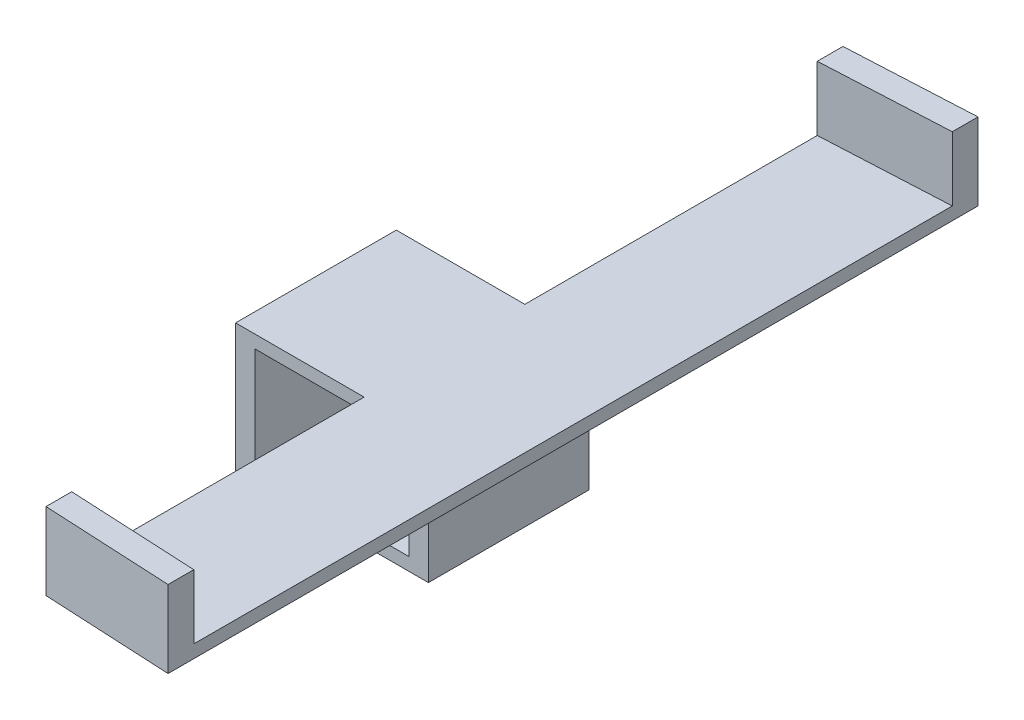
ISO-10303-21;
HEADER;
FILE_DESCRIPTION(('STEP AP214'),'2;1');
FILE_NAME('part.step','',(''),(''),'','','');
FILE_SCHEMA(('AUTOMOTIVE_DESIGN { 1 0 10303 214 1 1 1 1 }'));
ENDSEC;
DATA;
#1=APPLICATION_CONTEXT('core data for automotive mechanical design processes');
#2=APPLICATION_PROTOCOL_DEFINITION('international standard','automotive_design',2000,#1);
#3=PRODUCT_CONTEXT('',#1,'mechanical');
#4=PRODUCT('Part','Part','',(#3));
#5=PRODUCT_RELATED_PRODUCT_CATEGORY('part','',(#4));
#6=PRODUCT_DEFINITION_FORMATION('','',#4);
#7=PRODUCT_DEFINITION_CONTEXT('part definition',#1,'design');
#8=PRODUCT_DEFINITION('design','',#6,#7);
#9=PRODUCT_DEFINITION_SHAPE('','',#8);
#10=(LENGTH_UNIT() NAMED_UNIT(*) SI_UNIT(.MILLI.,.METRE.));
#11=(NAMED_UNIT(*) PLANE_ANGLE_UNIT() SI_UNIT($,.RADIAN.));
#12=(NAMED_UNIT(*) SI_UNIT($,.STERADIAN.) SOLID_ANGLE_UNIT());
#13=UNCERTAINTY_MEASURE_WITH_UNIT(LENGTH_MEASURE(1.E-05),#10,'distance_accuracy_value','');
#14=(GEOMETRIC_REPRESENTATION_CONTEXT(3) GLOBAL_UNCERTAINTY_ASSIGNED_CONTEXT((#13)) GLOBAL_UNIT_ASSIGNED_CONTEXT((#10,
#11,#12)) REPRESENTATION_CONTEXT('',''));
#15=CARTESIAN_POINT('',(0.,0.,0.));
#16=DIRECTION('',(0.,0.,1.));
#17=DIRECTION('',(1.,0.,0.));
#18=AXIS2_PLACEMENT_3D('',#15,#16,#17);
#19=CARTESIAN_POINT('',(0.,20.,0.));
#20=DIRECTION('',(0.,1.,0.));
#21=DIRECTION('',(0.,0.,1.));
#22=AXIS2_PLACEMENT_3D('',#19,#20,#21);
#23=PLANE('',#22);
#24=DIRECTION('',(0.998728172106602,0.,0.0504186298961642));
#25=VECTOR('',#24,1.);
#26=CARTESIAN_POINT('',(9.6788990825688,20.,58.9355386187338));
#27=LINE('',#26,#25);
#28=CARTESIAN_POINT('',(9.6788990825688,20.,58.9355386187338));
#29=VERTEX_POINT('',#28);
#30=CARTESIAN_POINT('',(29.6788990825688,20.,59.9451953262204));
#31=VERTEX_POINT('',#30);
#32=EDGE_CURVE('E59',#29,#31,#27,.T.);
#33=ORIENTED_EDGE('',*,*,#32,.T.);
#34=DIRECTION('',(0.,0.,1.));
#35=VECTOR('',#34,1.);
#36=CARTESIAN_POINT('',(29.6788990825688,20.,13.4403669724771));
#37=LINE('',#36,#35);
#38=CARTESIAN_POINT('',(29.6788990825688,20.,-58.0644613812662));
#39=VERTEX_POINT('',#38);
#40=EDGE_CURVE('E271',#39,#31,#37,.T.);
#41=ORIENTED_EDGE('',*,*,#40,.F.);
#42=DIRECTION('',(-0.998728172106602,0.,0.050418629896159));
#43=VECTOR('',#42,1.);
#44=CARTESIAN_POINT('',(29.6788990825688,20.,-58.0644613812662));
#45=LINE('',#44,#43);
#46=CARTESIAN_POINT('',(9.67889908256879,20.,-57.0548046737797));
#47=VERTEX_POINT('',#46);
#48=EDGE_CURVE('E201',#39,#47,#45,.T.);
#49=ORIENTED_EDGE('',*,*,#48,.T.);
#50=DIRECTION('',(0.,0.,1.));
#51=VECTOR('',#50,1.);
#52=CARTESIAN_POINT('',(9.6788990825688,20.,0.));
#53=LINE('',#52,#51);
#54=CARTESIAN_POINT('',(9.6788990825688,20.,-11.5596330275229));
#55=VERTEX_POINT('',#54);
#56=EDGE_CURVE('E180',#47,#55,#53,.T.);
#57=ORIENTED_EDGE('',*,*,#56,.T.);
#58=DIRECTION('',(-1.,0.,0.));
#59=VECTOR('',#58,1.);
#60=CARTESIAN_POINT('',(19.6788990825688,20.,-11.5596330275229));
#61=LINE('',#60,#59);
#62=CARTESIAN_POINT('',(-10.3211009174312,20.,-11.5596330275229));
#63=VERTEX_POINT('',#62);
#64=EDGE_CURVE('E333',#55,#63,#61,.T.);
#65=ORIENTED_EDGE('',*,*,#64,.T.);
#66=DIRECTION('',(0.,0.,1.));
#67=VECTOR('',#66,1.);
#68=CARTESIAN_POINT('',(-10.3211009174312,20.,-11.5596330275229));
#69=LINE('',#68,#67);
#70=CARTESIAN_POINT('',(-10.3211009174312,20.,13.4403669724771));
#71=VERTEX_POINT('',#70);
#72=EDGE_CURVE('E336',#63,#71,#69,.T.);
#73=ORIENTED_EDGE('',*,*,#72,.T.);
#74=DIRECTION('',(1.,0.,0.));
#75=VECTOR('',#74,1.);
#76=CARTESIAN_POINT('',(-10.3211009174312,20.,13.4403669724771));
#77=LINE('',#76,#75);
#78=CARTESIAN_POINT('',(9.6788990825688,20.,13.4403669724771));
#79=VERTEX_POINT('',#78);
#80=EDGE_CURVE('E340',#71,#79,#77,.T.);
#81=ORIENTED_EDGE('',*,*,#80,.T.);
#82=DIRECTION('',(0.,0.,1.));
#83=VECTOR('',#82,1.);
#84=CARTESIAN_POINT('',(9.6788990825688,20.,0.));
#85=LINE('',#84,#83);
#86=EDGE_CURVE('E64',#79,#29,#85,.T.);
#87=ORIENTED_EDGE('',*,*,#86,.T.);
#88=EDGE_LOOP('',(#33,#41,#49,#57,#65,#73,#81,#87));
#89=FACE_BOUND('',#88,.T.);
#90=ADVANCED_FACE('F41',(#89),#23,.T.);
#91=CARTESIAN_POINT('',(0.,18.,13.4403669724771));
#92=DIRECTION('',(0.,0.,-1.));
#93=DIRECTION('',(-1.,0.,0.));
#94=AXIS2_PLACEMENT_3D('',#91,#92,#93);
#95=PLANE('',#94);
#96=DIRECTION('',(1.,0.,0.));
#97=VECTOR('',#96,1.);
#98=CARTESIAN_POINT('',(0.,18.,13.4403669724771));
#99=LINE('',#98,#97);
#100=CARTESIAN_POINT('',(16.6788990825688,18.,13.4403669724771));
#101=VERTEX_POINT('',#100);
#102=CARTESIAN_POINT('',(19.6788990825688,18.,13.4403669724771));
#103=VERTEX_POINT('',#102);
#104=EDGE_CURVE('E11',#101,#103,#99,.T.);
#105=ORIENTED_EDGE('',*,*,#104,.F.);
#106=DIRECTION('',(0.,1.,0.));
#107=VECTOR('',#106,1.);
#108=CARTESIAN_POINT('',(16.6788990825688,2.,13.4403669724771));
#109=LINE('',#108,#107);
#110=CARTESIAN_POINT('',(16.6788990825688,2.,13.4403669724771));
#111=VERTEX_POINT('',#110);
#112=EDGE_CURVE('E297',#111,#101,#109,.T.);
#113=ORIENTED_EDGE('',*,*,#112,.F.);
#114=DIRECTION('',(1.,0.,0.));
#115=VECTOR('',#114,1.);
#116=CARTESIAN_POINT('',(-7.32110091743119,2.,13.4403669724771));
#117=LINE('',#116,#115);
#118=CARTESIAN_POINT('',(-7.32110091743119,2.,13.4403669724771));
#119=VERTEX_POINT('',#118);
#120=EDGE_CURVE('E274',#119,#111,#117,.T.);
#121=ORIENTED_EDGE('',*,*,#120,.F.);
#122=DIRECTION('',(0.,1.,0.));
#123=VECTOR('',#122,1.);
#124=CARTESIAN_POINT('',(-7.32110091743119,2.,13.4403669724771));
#125=LINE('',#124,#123);
#126=CARTESIAN_POINT('',(-7.32110091743119,18.,13.4403669724771));
#127=VERTEX_POINT('',#126);
#128=EDGE_CURVE('E283',#119,#127,#125,.T.);
#129=ORIENTED_EDGE('',*,*,#128,.T.);
#130=DIRECTION('',(-1.,0.,0.));
#131=VECTOR('',#130,1.);
#132=CARTESIAN_POINT('',(16.6788990825688,18.,13.4403669724771));
#133=LINE('',#132,#131);
#134=CARTESIAN_POINT('',(9.6788990825688,18.,13.4403669724771));
#135=VERTEX_POINT('',#134);
#136=EDGE_CURVE('E301',#135,#127,#133,.T.);
#137=ORIENTED_EDGE('',*,*,#136,.F.);
#138=DIRECTION('',(0.,1.,0.));
#139=VECTOR('',#138,1.);
#140=CARTESIAN_POINT('',(9.6788990825688,18.,13.4403669724771));
#141=LINE('',#140,#139);
#142=EDGE_CURVE('E181',#135,#79,#141,.T.);
#143=ORIENTED_EDGE('',*,*,#142,.T.);
#144=ORIENTED_EDGE('',*,*,#80,.F.);
#145=DIRECTION('',(0.,-1.,0.));
#146=VECTOR('',#145,1.);
#147=CARTESIAN_POINT('',(-10.3211009174312,18.,13.4403669724771));
#148=LINE('',#147,#146);
#149=CARTESIAN_POINT('',(-10.3211009174312,0.,13.4403669724771));
#150=VERTEX_POINT('',#149);
#151=EDGE_CURVE('E377',#71,#150,#148,.T.);
#152=ORIENTED_EDGE('',*,*,#151,.T.);
#153=DIRECTION('',(1.,0.,0.));
#154=VECTOR('',#153,1.);
#155=CARTESIAN_POINT('',(0.,0.,13.4403669724771));
#156=LINE('',#155,#154);
#157=CARTESIAN_POINT('',(19.6788990825688,0.,13.4403669724771));
#158=VERTEX_POINT('',#157);
#159=EDGE_CURVE('E354',#150,#158,#156,.T.);
#160=ORIENTED_EDGE('',*,*,#159,.T.);
#161=DIRECTION('',(0.,-1.,0.));
#162=VECTOR('',#161,1.);
#163=CARTESIAN_POINT('',(19.6788990825688,18.,13.4403669724771));
#164=LINE('',#163,#162);
#165=EDGE_CURVE('E374',#103,#158,#164,.T.);
#166=ORIENTED_EDGE('',*,*,#165,.F.);
#167=EDGE_LOOP('',(#105,#113,#121,#129,#137,#143,#144,#152,#160,#166));
#168=FACE_BOUND('',#167,.T.);
#169=ADVANCED_FACE('F404',(#168),#95,.F.);
#170=CARTESIAN_POINT('',(19.6788990825688,18.,0.));
#171=DIRECTION('',(1.,0.,0.));
#172=DIRECTION('',(0.,0.,-1.));
#173=AXIS2_PLACEMENT_3D('',#170,#171,#172);
#174=PLANE('',#173);
#175=DIRECTION('',(0.,0.,-1.));
#176=VECTOR('',#175,1.);
#177=CARTESIAN_POINT('',(19.6788990825688,18.,13.4403669724771));
#178=LINE('',#177,#176);
#179=CARTESIAN_POINT('',(19.6788990825688,18.,-11.5596330275229));
#180=VERTEX_POINT('',#179);
#181=EDGE_CURVE('E261',#103,#180,#178,.T.);
#182=ORIENTED_EDGE('',*,*,#181,.F.);
#183=ORIENTED_EDGE('',*,*,#165,.T.);
#184=DIRECTION('',(0.,0.,1.));
#185=VECTOR('',#184,1.);
#186=CARTESIAN_POINT('',(19.6788990825688,0.,0.));
#187=LINE('',#186,#185);
#188=CARTESIAN_POINT('',(19.6788990825688,0.,-11.5596330275229));
#189=VERTEX_POINT('',#188);
#190=EDGE_CURVE('E343',#189,#158,#187,.T.);
#191=ORIENTED_EDGE('',*,*,#190,.F.);
#192=DIRECTION('',(0.,-1.,0.));
#193=VECTOR('',#192,1.);
#194=CARTESIAN_POINT('',(19.6788990825688,18.,-11.5596330275229));
#195=LINE('',#194,#193);
#196=EDGE_CURVE('E255',#180,#189,#195,.T.);
#197=ORIENTED_EDGE('',*,*,#196,.F.);
#198=EDGE_LOOP('',(#182,#183,#191,#197));
#199=FACE_BOUND('',#198,.T.);
#200=ADVANCED_FACE('F43',(#199),#174,.T.);
#201=CARTESIAN_POINT('',(0.,18.,-11.5596330275229));
#202=DIRECTION('',(0.,0.,-1.));
#203=DIRECTION('',(-1.,0.,0.));
#204=AXIS2_PLACEMENT_3D('',#201,#202,#203);
#205=PLANE('',#204);
#206=DIRECTION('',(0.,1.,0.));
#207=VECTOR('',#206,1.);
#208=CARTESIAN_POINT('',(9.6788990825688,18.,-11.5596330275229));
#209=LINE('',#208,#207);
#210=CARTESIAN_POINT('',(9.6788990825688,18.,-11.5596330275229));
#211=VERTEX_POINT('',#210);
#212=EDGE_CURVE('E262',#211,#55,#209,.T.);
#213=ORIENTED_EDGE('',*,*,#212,.F.);
#214=DIRECTION('',(-1.,0.,0.));
#215=VECTOR('',#214,1.);
#216=CARTESIAN_POINT('',(16.6788990825688,18.,-11.5596330275229));
#217=LINE('',#216,#215);
#218=CARTESIAN_POINT('',(-7.32110091743119,18.,-11.5596330275229));
#219=VERTEX_POINT('',#218);
#220=EDGE_CURVE('E287',#211,#219,#217,.T.);
#221=ORIENTED_EDGE('',*,*,#220,.T.);
#222=DIRECTION('',(0.,1.,0.));
#223=VECTOR('',#222,1.);
#224=CARTESIAN_POINT('',(-7.32110091743119,2.,-11.5596330275229));
#225=LINE('',#224,#223);
#226=CARTESIAN_POINT('',(-7.32110091743119,2.,-11.5596330275229));
#227=VERTEX_POINT('',#226);
#228=EDGE_CURVE('E290',#227,#219,#225,.T.);
#229=ORIENTED_EDGE('',*,*,#228,.F.);
#230=DIRECTION('',(1.,0.,0.));
#231=VECTOR('',#230,1.);
#232=CARTESIAN_POINT('',(-7.32110091743119,2.,-11.5596330275229));
#233=LINE('',#232,#231);
#234=CARTESIAN_POINT('',(16.6788990825688,2.,-11.5596330275229));
#235=VERTEX_POINT('',#234);
#236=EDGE_CURVE('E278',#227,#235,#233,.T.);
#237=ORIENTED_EDGE('',*,*,#236,.T.);
#238=DIRECTION('',(0.,1.,0.));
#239=VECTOR('',#238,1.);
#240=CARTESIAN_POINT('',(16.6788990825688,2.,-11.5596330275229));
#241=LINE('',#240,#239);
#242=CARTESIAN_POINT('',(16.6788990825688,18.,-11.5596330275229));
#243=VERTEX_POINT('',#242);
#244=EDGE_CURVE('E282',#235,#243,#241,.T.);
#245=ORIENTED_EDGE('',*,*,#244,.T.);
#246=DIRECTION('',(-1.,0.,0.));
#247=VECTOR('',#246,1.);
#248=CARTESIAN_POINT('',(0.,18.,-11.5596330275229));
#249=LINE('',#248,#247);
#250=EDGE_CURVE('E51',#180,#243,#249,.T.);
#251=ORIENTED_EDGE('',*,*,#250,.F.);
#252=ORIENTED_EDGE('',*,*,#196,.T.);
#253=DIRECTION('',(1.,0.,0.));
#254=VECTOR('',#253,1.);
#255=CARTESIAN_POINT('',(0.,0.,-11.5596330275229));
#256=LINE('',#255,#254);
#257=CARTESIAN_POINT('',(-10.3211009174312,0.,-11.5596330275229));
#258=VERTEX_POINT('',#257);
#259=EDGE_CURVE('E347',#258,#189,#256,.T.);
#260=ORIENTED_EDGE('',*,*,#259,.F.);
#261=DIRECTION('',(0.,-1.,0.));
#262=VECTOR('',#261,1.);
#263=CARTESIAN_POINT('',(-10.3211009174312,18.,-11.5596330275229));
#264=LINE('',#263,#262);
#265=EDGE_CURVE('E381',#63,#258,#264,.T.);
#266=ORIENTED_EDGE('',*,*,#265,.F.);
#267=ORIENTED_EDGE('',*,*,#64,.F.);
#268=EDGE_LOOP('',(#213,#221,#229,#237,#245,#251,#252,#260,#266,#267));
#269=FACE_BOUND('',#268,.T.);
#270=ADVANCED_FACE('F389',(#269),#205,.T.);
#271=CARTESIAN_POINT('',(-10.3211009174312,18.,0.));
#272=DIRECTION('',(1.,0.,0.));
#273=DIRECTION('',(0.,0.,-1.));
#274=AXIS2_PLACEMENT_3D('',#271,#272,#273);
#275=PLANE('',#274);
#276=DIRECTION('',(0.,0.,1.));
#277=VECTOR('',#276,1.);
#278=CARTESIAN_POINT('',(-10.3211009174312,0.,0.));
#279=LINE('',#278,#277);
#280=EDGE_CURVE('E351',#258,#150,#279,.T.);
#281=ORIENTED_EDGE('',*,*,#280,.T.);
#282=ORIENTED_EDGE('',*,*,#151,.F.);
#283=ORIENTED_EDGE('',*,*,#72,.F.);
#284=ORIENTED_EDGE('',*,*,#265,.T.);
#285=EDGE_LOOP('',(#281,#282,#283,#284));
#286=FACE_BOUND('',#285,.T.);
#287=ADVANCED_FACE('F400',(#286),#275,.F.);
#288=CARTESIAN_POINT('',(-3.07110091743119,18.,-7.55963302752294));
#289=DIRECTION('',(0.,-1.,0.));
#290=DIRECTION('',(0.,0.,-1.));
#291=AXIS2_PLACEMENT_3D('',#288,#289,#290);
#292=CYLINDRICAL_SURFACE('',#291,1.45);
#293=CARTESIAN_POINT('',(-3.07110091743119,2.,-7.55963302752294));
#294=DIRECTION('',(0.,-1.,0.));
#295=DIRECTION('',(0.,0.,-1.));
#296=AXIS2_PLACEMENT_3D('',#293,#294,#295);
#297=CIRCLE('',#296,1.45);
#298=CARTESIAN_POINT('',(-3.07110091743119,2.,-9.00963302752294));
#299=VERTEX_POINT('',#298);
#300=EDGE_CURVE('E329',#299,#299,#297,.T.);
#301=ORIENTED_EDGE('',*,*,#300,.F.);
#302=EDGE_LOOP('',(#301));
#303=FACE_BOUND('',#302,.T.);
#304=CARTESIAN_POINT('',(-3.07110091743119,0.,-7.55963302752294));
#305=DIRECTION('',(0.,1.,0.));
#306=DIRECTION('',(0.,0.,1.));
#307=AXIS2_PLACEMENT_3D('',#304,#305,#306);
#308=CIRCLE('',#307,1.45);
#309=CARTESIAN_POINT('',(-3.07110091743119,0.,-6.10963302752294));
#310=VERTEX_POINT('',#309);
#311=EDGE_CURVE('E366',#310,#310,#308,.T.);
#312=ORIENTED_EDGE('',*,*,#311,.F.);
#313=EDGE_LOOP('',(#312));
#314=FACE_BOUND('',#313,.T.);
#315=ADVANCED_FACE('F643',(#303,#314),#292,.F.);
#316=CARTESIAN_POINT('',(12.4288990825688,18.,9.44036697247706));
#317=DIRECTION('',(0.,-1.,0.));
#318=DIRECTION('',(0.,0.,-1.));
#319=AXIS2_PLACEMENT_3D('',#316,#317,#318);
#320=CYLINDRICAL_SURFACE('',#319,1.45);
#321=CARTESIAN_POINT('',(12.4288990825688,2.,9.44036697247706));
#322=DIRECTION('',(0.,-1.,0.));
#323=DIRECTION('',(0.,0.,-1.));
#324=AXIS2_PLACEMENT_3D('',#321,#322,#323);
#325=CIRCLE('',#324,1.45);
#326=CARTESIAN_POINT('',(12.4288990825688,2.,7.99036697247706));
#327=VERTEX_POINT('',#326);
#328=EDGE_CURVE('E325',#327,#327,#325,.F.);
#329=ORIENTED_EDGE('',*,*,#328,.T.);
#330=EDGE_LOOP('',(#329));
#331=FACE_BOUND('',#330,.T.);
#332=CARTESIAN_POINT('',(12.4288990825688,0.,9.44036697247706));
#333=DIRECTION('',(0.,1.,0.));
#334=DIRECTION('',(0.,0.,1.));
#335=AXIS2_PLACEMENT_3D('',#332,#333,#334);
#336=CIRCLE('',#335,1.45);
#337=CARTESIAN_POINT('',(12.4288990825688,0.,10.8903669724771));
#338=VERTEX_POINT('',#337);
#339=EDGE_CURVE('E362',#338,#338,#336,.F.);
#340=ORIENTED_EDGE('',*,*,#339,.T.);
#341=EDGE_LOOP('',(#340));
#342=FACE_BOUND('',#341,.T.);
#343=ADVANCED_FACE('F633',(#331,#342),#320,.F.);
#344=CARTESIAN_POINT('',(-3.07110091743119,18.,9.44036697247706));
#345=DIRECTION('',(0.,-1.,0.));
#346=DIRECTION('',(0.,0.,-1.));
#347=AXIS2_PLACEMENT_3D('',#344,#345,#346);
#348=CYLINDRICAL_SURFACE('',#347,1.45);
#349=CARTESIAN_POINT('',(-3.07110091743119,2.,9.44036697247706));
#350=DIRECTION('',(0.,-1.,0.));
#351=DIRECTION('',(0.,0.,-1.));
#352=AXIS2_PLACEMENT_3D('',#349,#350,#351);
#353=CIRCLE('',#352,1.45);
#354=CARTESIAN_POINT('',(-3.07110091743119,2.,7.99036697247706));
#355=VERTEX_POINT('',#354);
#356=EDGE_CURVE('E321',#355,#355,#353,.F.);
#357=ORIENTED_EDGE('',*,*,#356,.T.);
#358=EDGE_LOOP('',(#357));
#359=FACE_BOUND('',#358,.T.);
#360=CARTESIAN_POINT('',(-3.07110091743119,0.,9.44036697247706));
#361=DIRECTION('',(0.,1.,0.));
#362=DIRECTION('',(0.,0.,1.));
#363=AXIS2_PLACEMENT_3D('',#360,#361,#362);
#364=CIRCLE('',#363,1.45);
#365=CARTESIAN_POINT('',(-3.07110091743119,0.,10.8903669724771));
#366=VERTEX_POINT('',#365);
#367=EDGE_CURVE('E358',#366,#366,#364,.F.);
#368=ORIENTED_EDGE('',*,*,#367,.T.);
#369=EDGE_LOOP('',(#368));
#370=FACE_BOUND('',#369,.T.);
#371=ADVANCED_FACE('F622',(#359,#370),#348,.F.);
#372=CARTESIAN_POINT('',(12.4288990825688,18.,-7.55963302752294));
#373=DIRECTION('',(0.,-1.,0.));
#374=DIRECTION('',(0.,0.,-1.));
#375=AXIS2_PLACEMENT_3D('',#372,#373,#374);
#376=CYLINDRICAL_SURFACE('',#375,1.45);
#377=CARTESIAN_POINT('',(12.4288990825688,2.,-7.55963302752294));
#378=DIRECTION('',(0.,-1.,0.));
#379=DIRECTION('',(0.,0.,-1.));
#380=AXIS2_PLACEMENT_3D('',#377,#378,#379);
#381=CIRCLE('',#380,1.45);
#382=CARTESIAN_POINT('',(12.4288990825688,2.,-9.00963302752294));
#383=VERTEX_POINT('',#382);
#384=EDGE_CURVE('E45',#383,#383,#381,.T.);
#385=ORIENTED_EDGE('',*,*,#384,.F.);
#386=EDGE_LOOP('',(#385));
#387=FACE_BOUND('',#386,.T.);
#388=CARTESIAN_POINT('',(12.4288990825688,0.,-7.55963302752294));
#389=DIRECTION('',(0.,1.,0.));
#390=DIRECTION('',(0.,0.,1.));
#391=AXIS2_PLACEMENT_3D('',#388,#389,#390);
#392=CIRCLE('',#391,1.45);
#393=CARTESIAN_POINT('',(12.4288990825688,0.,-6.10963302752294));
#394=VERTEX_POINT('',#393);
#395=EDGE_CURVE('E370',#394,#394,#392,.T.);
#396=ORIENTED_EDGE('',*,*,#395,.F.);
#397=EDGE_LOOP('',(#396));
#398=FACE_BOUND('',#397,.T.);
#399=ADVANCED_FACE('F617',(#387,#398),#376,.F.);
#400=CARTESIAN_POINT('',(0.,0.,0.));
#401=DIRECTION('',(0.,1.,0.));
#402=DIRECTION('',(0.,0.,1.));
#403=AXIS2_PLACEMENT_3D('',#400,#401,#402);
#404=PLANE('',#403);
#405=ORIENTED_EDGE('',*,*,#190,.T.);
#406=ORIENTED_EDGE('',*,*,#159,.F.);
#407=ORIENTED_EDGE('',*,*,#280,.F.);
#408=ORIENTED_EDGE('',*,*,#259,.T.);
#409=EDGE_LOOP('',(#405,#406,#407,#408));
#410=FACE_BOUND('',#409,.T.);
#411=ORIENTED_EDGE('',*,*,#367,.F.);
#412=EDGE_LOOP('',(#411));
#413=FACE_BOUND('',#412,.T.);
#414=ORIENTED_EDGE('',*,*,#339,.F.);
#415=EDGE_LOOP('',(#414));
#416=FACE_BOUND('',#415,.T.);
#417=ORIENTED_EDGE('',*,*,#311,.T.);
#418=EDGE_LOOP('',(#417));
#419=FACE_BOUND('',#418,.T.);
#420=ORIENTED_EDGE('',*,*,#395,.T.);
#421=EDGE_LOOP('',(#420));
#422=FACE_BOUND('',#421,.T.);
#423=ADVANCED_FACE('F397',(#410,#413,#416,#419,#422),#404,.F.);
#424=CARTESIAN_POINT('',(-7.32110091743119,2.,-11.5596330275229));
#425=DIRECTION('',(0.,-1.,0.));
#426=DIRECTION('',(0.,0.,-1.));
#427=AXIS2_PLACEMENT_3D('',#424,#425,#426);
#428=PLANE('',#427);
#429=ORIENTED_EDGE('',*,*,#300,.T.);
#430=EDGE_LOOP('',(#429));
#431=FACE_BOUND('',#430,.T.);
#432=ORIENTED_EDGE('',*,*,#356,.F.);
#433=EDGE_LOOP('',(#432));
#434=FACE_BOUND('',#433,.T.);
#435=ORIENTED_EDGE('',*,*,#384,.T.);
#436=EDGE_LOOP('',(#435));
#437=FACE_BOUND('',#436,.T.);
#438=ORIENTED_EDGE('',*,*,#120,.T.);
#439=DIRECTION('',(0.,0.,1.));
#440=VECTOR('',#439,1.);
#441=CARTESIAN_POINT('',(16.6788990825688,2.,-11.5596330275229));
#442=LINE('',#441,#440);
#443=EDGE_CURVE('E294',#235,#111,#442,.T.);
#444=ORIENTED_EDGE('',*,*,#443,.F.);
#445=ORIENTED_EDGE('',*,*,#236,.F.);
#446=DIRECTION('',(0.,0.,1.));
#447=VECTOR('',#446,1.);
#448=CARTESIAN_POINT('',(-7.32110091743119,2.,-11.5596330275229));
#449=LINE('',#448,#447);
#450=EDGE_CURVE('E307',#227,#119,#449,.T.);
#451=ORIENTED_EDGE('',*,*,#450,.T.);
#452=EDGE_LOOP('',(#438,#444,#445,#451));
#453=FACE_BOUND('',#452,.T.);
#454=ORIENTED_EDGE('',*,*,#328,.F.);
#455=EDGE_LOOP('',(#454));
#456=FACE_BOUND('',#455,.T.);
#457=ADVANCED_FACE('F432',(#431,#434,#437,#453,#456),#428,.F.);
#458=CARTESIAN_POINT('',(-7.32110091743119,2.,-11.5596330275229));
#459=DIRECTION('',(1.,0.,0.));
#460=DIRECTION('',(0.,1.,0.));
#461=AXIS2_PLACEMENT_3D('',#458,#459,#460);
#462=PLANE('',#461);
#463=ORIENTED_EDGE('',*,*,#128,.F.);
#464=ORIENTED_EDGE('',*,*,#450,.F.);
#465=ORIENTED_EDGE('',*,*,#228,.T.);
#466=DIRECTION('',(0.,0.,1.));
#467=VECTOR('',#466,1.);
#468=CARTESIAN_POINT('',(-7.32110091743119,18.,-11.5596330275229));
#469=LINE('',#468,#467);
#470=EDGE_CURVE('E310',#219,#127,#469,.T.);
#471=ORIENTED_EDGE('',*,*,#470,.T.);
#472=EDGE_LOOP('',(#463,#464,#465,#471));
#473=FACE_BOUND('',#472,.T.);
#474=ADVANCED_FACE('F427',(#473),#462,.T.);
#475=CARTESIAN_POINT('',(16.6788990825688,2.,-11.5596330275229));
#476=DIRECTION('',(1.,0.,0.));
#477=DIRECTION('',(0.,0.,-1.));
#478=AXIS2_PLACEMENT_3D('',#475,#476,#477);
#479=PLANE('',#478);
#480=ORIENTED_EDGE('',*,*,#112,.T.);
#481=DIRECTION('',(0.,0.,1.));
#482=VECTOR('',#481,1.);
#483=CARTESIAN_POINT('',(16.6788990825688,18.,-11.5596330275229));
#484=LINE('',#483,#482);
#485=EDGE_CURVE('E314',#243,#101,#484,.T.);
#486=ORIENTED_EDGE('',*,*,#485,.F.);
#487=ORIENTED_EDGE('',*,*,#244,.F.);
#488=ORIENTED_EDGE('',*,*,#443,.T.);
#489=EDGE_LOOP('',(#480,#486,#487,#488));
#490=FACE_BOUND('',#489,.T.);
#491=ADVANCED_FACE('F435',(#490),#479,.F.);
#492=CARTESIAN_POINT('',(0.,18.,0.));
#493=DIRECTION('',(0.,1.,0.));
#494=DIRECTION('',(0.,0.,1.));
#495=AXIS2_PLACEMENT_3D('',#492,#493,#494);
#496=PLANE('',#495);
#497=DIRECTION('',(0.,0.,1.));
#498=VECTOR('',#497,1.);
#499=CARTESIAN_POINT('',(9.6788990825688,18.,0.));
#500=LINE('',#499,#498);
#501=CARTESIAN_POINT('',(9.6788990825688,18.,62.9355386187338));
#502=VERTEX_POINT('',#501);
#503=EDGE_CURVE('E175',#135,#502,#500,.T.);
#504=ORIENTED_EDGE('',*,*,#503,.F.);
#505=ORIENTED_EDGE('',*,*,#136,.T.);
#506=ORIENTED_EDGE('',*,*,#470,.F.);
#507=ORIENTED_EDGE('',*,*,#220,.F.);
#508=DIRECTION('',(0.,0.,1.));
#509=VECTOR('',#508,1.);
#510=CARTESIAN_POINT('',(9.6788990825688,18.,0.));
#511=LINE('',#510,#509);
#512=CARTESIAN_POINT('',(9.67889908256879,18.,-61.0548046737797));
#513=VERTEX_POINT('',#512);
#514=EDGE_CURVE('E247',#513,#211,#511,.T.);
#515=ORIENTED_EDGE('',*,*,#514,.F.);
#516=DIRECTION('',(-0.998728172106602,0.,0.0504186298961593));
#517=VECTOR('',#516,1.);
#518=CARTESIAN_POINT('',(-3.04978040133893,18.,-60.412224842861));
#519=LINE('',#518,#517);
#520=CARTESIAN_POINT('',(29.6788990825688,18.,-62.0644613812662));
#521=VERTEX_POINT('',#520);
#522=EDGE_CURVE('E243',#521,#513,#519,.T.);
#523=ORIENTED_EDGE('',*,*,#522,.F.);
#524=DIRECTION('',(0.,0.,-1.));
#525=VECTOR('',#524,1.);
#526=CARTESIAN_POINT('',(29.6788990825688,18.,13.4403669724771));
#527=LINE('',#526,#525);
#528=CARTESIAN_POINT('',(29.6788990825688,18.,63.9451953262204));
#529=VERTEX_POINT('',#528);
#530=EDGE_CURVE('E268',#529,#521,#527,.T.);
#531=ORIENTED_EDGE('',*,*,#530,.F.);
#532=DIRECTION('',(-0.998728172106602,0.,-0.0504186298961656));
#533=VECTOR('',#532,1.);
#534=CARTESIAN_POINT('',(-3.14448383019843,18.,62.2881778902065));
#535=LINE('',#534,#533);
#536=EDGE_CURVE('E231',#529,#502,#535,.T.);
#537=ORIENTED_EDGE('',*,*,#536,.T.);
#538=EDGE_LOOP('',(#504,#505,#506,#507,#515,#523,#531,#537));
#539=FACE_BOUND('',#538,.T.);
#540=ORIENTED_EDGE('',*,*,#485,.T.);
#541=ORIENTED_EDGE('',*,*,#104,.T.);
#542=ORIENTED_EDGE('',*,*,#181,.T.);
#543=ORIENTED_EDGE('',*,*,#250,.T.);
#544=EDGE_LOOP('',(#540,#541,#542,#543));
#545=FACE_BOUND('',#544,.T.);
#546=ADVANCED_FACE('F413',(#539,#545),#496,.F.);
#547=CARTESIAN_POINT('',(29.6788990825688,0.,0.));
#548=DIRECTION('',(-1.,0.,0.));
#549=DIRECTION('',(0.,0.,1.));
#550=AXIS2_PLACEMENT_3D('',#547,#548,#549);
#551=PLANE('',#550);
#552=DIRECTION('',(0.,1.,0.));
#553=VECTOR('',#552,1.);
#554=CARTESIAN_POINT('',(29.6788990825688,18.,-62.0644613812662));
#555=LINE('',#554,#553);
#556=CARTESIAN_POINT('',(29.6788990825688,30.,-62.0644613812662));
#557=VERTEX_POINT('',#556);
#558=EDGE_CURVE('E258',#521,#557,#555,.T.);
#559=ORIENTED_EDGE('',*,*,#558,.T.);
#560=DIRECTION('',(0.,0.,1.));
#561=VECTOR('',#560,1.);
#562=CARTESIAN_POINT('',(29.6788990825688,30.,-62.0644613812662));
#563=LINE('',#562,#561);
#564=CARTESIAN_POINT('',(29.6788990825688,30.,-58.0644613812662));
#565=VERTEX_POINT('',#564);
#566=EDGE_CURVE('E218',#557,#565,#563,.T.);
#567=ORIENTED_EDGE('',*,*,#566,.T.);
#568=DIRECTION('',(0.,-1.,0.));
#569=VECTOR('',#568,1.);
#570=CARTESIAN_POINT('',(29.6788990825688,30.,-58.0644613812662));
#571=LINE('',#570,#569);
#572=EDGE_CURVE('E226',#565,#39,#571,.T.);
#573=ORIENTED_EDGE('',*,*,#572,.T.);
#574=ORIENTED_EDGE('',*,*,#40,.T.);
#575=DIRECTION('',(0.,-1.,0.));
#576=VECTOR('',#575,1.);
#577=CARTESIAN_POINT('',(29.6788990825688,30.,59.9451953262204));
#578=LINE('',#577,#576);
#579=CARTESIAN_POINT('',(29.6788990825688,30.,59.9451953262204));
#580=VERTEX_POINT('',#579);
#581=EDGE_CURVE('E482',#580,#31,#578,.T.);
#582=ORIENTED_EDGE('',*,*,#581,.F.);
#583=DIRECTION('',(0.,0.,-1.));
#584=VECTOR('',#583,1.);
#585=CARTESIAN_POINT('',(29.6788990825688,30.,63.9451953262204));
#586=LINE('',#585,#584);
#587=CARTESIAN_POINT('',(29.6788990825688,30.,63.9451953262204));
#588=VERTEX_POINT('',#587);
#589=EDGE_CURVE('E197',#588,#580,#586,.T.);
#590=ORIENTED_EDGE('',*,*,#589,.F.);
#591=DIRECTION('',(0.,1.,0.));
#592=VECTOR('',#591,1.);
#593=CARTESIAN_POINT('',(29.6788990825688,18.,63.9451953262204));
#594=LINE('',#593,#592);
#595=EDGE_CURVE('E194',#529,#588,#594,.T.);
#596=ORIENTED_EDGE('',*,*,#595,.F.);
#597=ORIENTED_EDGE('',*,*,#530,.T.);
#598=EDGE_LOOP('',(#559,#567,#573,#574,#582,#590,#596,#597));
#599=FACE_BOUND('',#598,.T.);
#600=ADVANCED_FACE('F422',(#599),#551,.F.);
#601=CARTESIAN_POINT('',(-3.04978040133893,18.,-60.412224842861));
#602=DIRECTION('',(-0.0504186298961593,0.,-0.998728172106602));
#603=DIRECTION('',(-0.998728172106602,0.,0.0504186298961593));
#604=AXIS2_PLACEMENT_3D('',#601,#602,#603);
#605=PLANE('',#604);
#606=DIRECTION('',(0.,1.,0.));
#607=VECTOR('',#606,1.);
#608=CARTESIAN_POINT('',(9.67889908256879,18.,-61.0548046737797));
#609=LINE('',#608,#607);
#610=CARTESIAN_POINT('',(9.67889908256879,30.,-61.0548046737797));
#611=VERTEX_POINT('',#610);
#612=EDGE_CURVE('E251',#513,#611,#609,.T.);
#613=ORIENTED_EDGE('',*,*,#612,.T.);
#614=DIRECTION('',(0.998728172106602,0.,-0.050418629896159));
#615=VECTOR('',#614,1.);
#616=CARTESIAN_POINT('',(9.67889908256879,30.,-61.0548046737797));
#617=LINE('',#616,#615);
#618=EDGE_CURVE('E214',#611,#557,#617,.T.);
#619=ORIENTED_EDGE('',*,*,#618,.T.);
#620=ORIENTED_EDGE('',*,*,#558,.F.);
#621=ORIENTED_EDGE('',*,*,#522,.T.);
#622=EDGE_LOOP('',(#613,#619,#620,#621));
#623=FACE_BOUND('',#622,.T.);
#624=ADVANCED_FACE('F418',(#623),#605,.T.);
#625=CARTESIAN_POINT('',(9.6788990825688,18.,0.));
#626=DIRECTION('',(-1.,0.,0.));
#627=DIRECTION('',(0.,0.,1.));
#628=AXIS2_PLACEMENT_3D('',#625,#626,#627);
#629=PLANE('',#628);
#630=ORIENTED_EDGE('',*,*,#56,.F.);
#631=DIRECTION('',(0.,-1.,0.));
#632=VECTOR('',#631,1.);
#633=CARTESIAN_POINT('',(9.67889908256879,30.,-57.0548046737797));
#634=LINE('',#633,#632);
#635=CARTESIAN_POINT('',(9.67889908256879,30.,-57.0548046737797));
#636=VERTEX_POINT('',#635);
#637=EDGE_CURVE('E222',#636,#47,#634,.T.);
#638=ORIENTED_EDGE('',*,*,#637,.F.);
#639=DIRECTION('',(0.,0.,-1.));
#640=VECTOR('',#639,1.);
#641=CARTESIAN_POINT('',(9.67889908256879,30.,-57.0548046737797));
#642=LINE('',#641,#640);
#643=EDGE_CURVE('E210',#636,#611,#642,.T.);
#644=ORIENTED_EDGE('',*,*,#643,.T.);
#645=ORIENTED_EDGE('',*,*,#612,.F.);
#646=ORIENTED_EDGE('',*,*,#514,.T.);
#647=ORIENTED_EDGE('',*,*,#212,.T.);
#648=EDGE_LOOP('',(#630,#638,#644,#645,#646,#647));
#649=FACE_BOUND('',#648,.T.);
#650=ADVANCED_FACE('F409',(#649),#629,.T.);
#651=CARTESIAN_POINT('',(-3.14448383019843,18.,62.2881778902065));
#652=DIRECTION('',(0.0504186298961656,0.,-0.998728172106601));
#653=DIRECTION('',(-0.998728172106602,0.,-0.0504186298961656));
#654=AXIS2_PLACEMENT_3D('',#651,#652,#653);
#655=PLANE('',#654);
#656=ORIENTED_EDGE('',*,*,#595,.T.);
#657=DIRECTION('',(0.998728172106601,0.,0.0504186298961642));
#658=VECTOR('',#657,1.);
#659=CARTESIAN_POINT('',(9.6788990825688,30.,62.9355386187338));
#660=LINE('',#659,#658);
#661=CARTESIAN_POINT('',(9.6788990825688,30.,62.9355386187338));
#662=VERTEX_POINT('',#661);
#663=EDGE_CURVE('E186',#662,#588,#660,.T.);
#664=ORIENTED_EDGE('',*,*,#663,.F.);
#665=DIRECTION('',(0.,1.,0.));
#666=VECTOR('',#665,1.);
#667=CARTESIAN_POINT('',(9.6788990825688,18.,62.9355386187338));
#668=LINE('',#667,#666);
#669=EDGE_CURVE('E169',#502,#662,#668,.T.);
#670=ORIENTED_EDGE('',*,*,#669,.F.);
#671=ORIENTED_EDGE('',*,*,#536,.F.);
#672=EDGE_LOOP('',(#656,#664,#670,#671));
#673=FACE_BOUND('',#672,.T.);
#674=ADVANCED_FACE('F192',(#673),#655,.F.);
#675=CARTESIAN_POINT('',(9.6788990825688,18.,0.));
#676=DIRECTION('',(-1.,0.,0.));
#677=DIRECTION('',(0.,0.,1.));
#678=AXIS2_PLACEMENT_3D('',#675,#676,#677);
#679=PLANE('',#678);
#680=ORIENTED_EDGE('',*,*,#86,.F.);
#681=ORIENTED_EDGE('',*,*,#142,.F.);
#682=ORIENTED_EDGE('',*,*,#503,.T.);
#683=ORIENTED_EDGE('',*,*,#669,.T.);
#684=DIRECTION('',(0.,0.,1.));
#685=VECTOR('',#684,1.);
#686=CARTESIAN_POINT('',(9.6788990825688,30.,58.9355386187338));
#687=LINE('',#686,#685);
#688=CARTESIAN_POINT('',(9.6788990825688,30.,58.9355386187338));
#689=VERTEX_POINT('',#688);
#690=EDGE_CURVE('E172',#689,#662,#687,.T.);
#691=ORIENTED_EDGE('',*,*,#690,.F.);
#692=DIRECTION('',(0.,-1.,0.));
#693=VECTOR('',#692,1.);
#694=CARTESIAN_POINT('',(9.6788990825688,30.,58.9355386187338));
#695=LINE('',#694,#693);
#696=EDGE_CURVE('E190',#689,#29,#695,.T.);
#697=ORIENTED_EDGE('',*,*,#696,.T.);
#698=EDGE_LOOP('',(#680,#681,#682,#683,#691,#697));
#699=FACE_BOUND('',#698,.T.);
#700=ADVANCED_FACE('F171',(#699),#679,.T.);
#701=CARTESIAN_POINT('',(29.6788990825688,30.,-58.0644613812662));
#702=DIRECTION('',(0.050418629896159,0.,0.998728172106602));
#703=DIRECTION('',(0.998728172106602,0.,-0.050418629896159));
#704=AXIS2_PLACEMENT_3D('',#701,#702,#703);
#705=PLANE('',#704);
#706=ORIENTED_EDGE('',*,*,#48,.F.);
#707=ORIENTED_EDGE('',*,*,#572,.F.);
#708=DIRECTION('',(-0.998728172106602,0.,0.050418629896159));
#709=VECTOR('',#708,1.);
#710=CARTESIAN_POINT('',(29.6788990825688,30.,-58.0644613812662));
#711=LINE('',#710,#709);
#712=EDGE_CURVE('E206',#565,#636,#711,.T.);
#713=ORIENTED_EDGE('',*,*,#712,.T.);
#714=ORIENTED_EDGE('',*,*,#637,.T.);
#715=EDGE_LOOP('',(#706,#707,#713,#714));
#716=FACE_BOUND('',#715,.T.);
#717=ADVANCED_FACE('F465',(#716),#705,.T.);
#718=CARTESIAN_POINT('',(0.,30.,0.));
#719=DIRECTION('',(0.,-1.,0.));
#720=DIRECTION('',(0.,0.,-1.));
#721=AXIS2_PLACEMENT_3D('',#718,#719,#720);
#722=PLANE('',#721);
#723=ORIENTED_EDGE('',*,*,#712,.F.);
#724=ORIENTED_EDGE('',*,*,#566,.F.);
#725=ORIENTED_EDGE('',*,*,#618,.F.);
#726=ORIENTED_EDGE('',*,*,#643,.F.);
#727=EDGE_LOOP('',(#723,#724,#725,#726));
#728=FACE_BOUND('',#727,.T.);
#729=ADVANCED_FACE('F468',(#728),#722,.F.);
#730=CARTESIAN_POINT('',(9.6788990825688,30.,58.9355386187338));
#731=DIRECTION('',(0.0504186298961642,0.,-0.998728172106602));
#732=DIRECTION('',(-0.998728172106602,0.,-0.0504186298961642));
#733=AXIS2_PLACEMENT_3D('',#730,#731,#732);
#734=PLANE('',#733);
#735=ORIENTED_EDGE('',*,*,#32,.F.);
#736=ORIENTED_EDGE('',*,*,#696,.F.);
#737=DIRECTION('',(0.998728172106602,0.,0.0504186298961642));
#738=VECTOR('',#737,1.);
#739=CARTESIAN_POINT('',(9.6788990825688,30.,58.9355386187338));
#740=LINE('',#739,#738);
#741=EDGE_CURVE('E188',#689,#580,#740,.T.);
#742=ORIENTED_EDGE('',*,*,#741,.T.);
#743=ORIENTED_EDGE('',*,*,#581,.T.);
#744=EDGE_LOOP('',(#735,#736,#742,#743));
#745=FACE_BOUND('',#744,.T.);
#746=ADVANCED_FACE('F472',(#745),#734,.T.);
#747=CARTESIAN_POINT('',(0.,30.,0.));
#748=DIRECTION('',(0.,1.,0.));
#749=DIRECTION('',(0.,0.,1.));
#750=AXIS2_PLACEMENT_3D('',#747,#748,#749);
#751=PLANE('',#750);
#752=ORIENTED_EDGE('',*,*,#663,.T.);
#753=ORIENTED_EDGE('',*,*,#589,.T.);
#754=ORIENTED_EDGE('',*,*,#741,.F.);
#755=ORIENTED_EDGE('',*,*,#690,.T.);
#756=EDGE_LOOP('',(#752,#753,#754,#755));
#757=FACE_BOUND('',#756,.T.);
#758=ADVANCED_FACE('F185',(#757),#751,.T.);
#759=CLOSED_SHELL('',(#90,#169,#200,#270,#287,#315,#343,#371,#399,#423,#457,#474,#491,#546,#600,
#624,#650,#674,#700,#717,#729,#746,#758));
#760=MANIFOLD_SOLID_BREP('B2',#759);
#761=ADVANCED_BREP_SHAPE_REPRESENTATION('',(#18,#760),#14);
#762=SHAPE_DEFINITION_REPRESENTATION(#9,#761);
ENDSEC;
END-ISO-10303-21;
